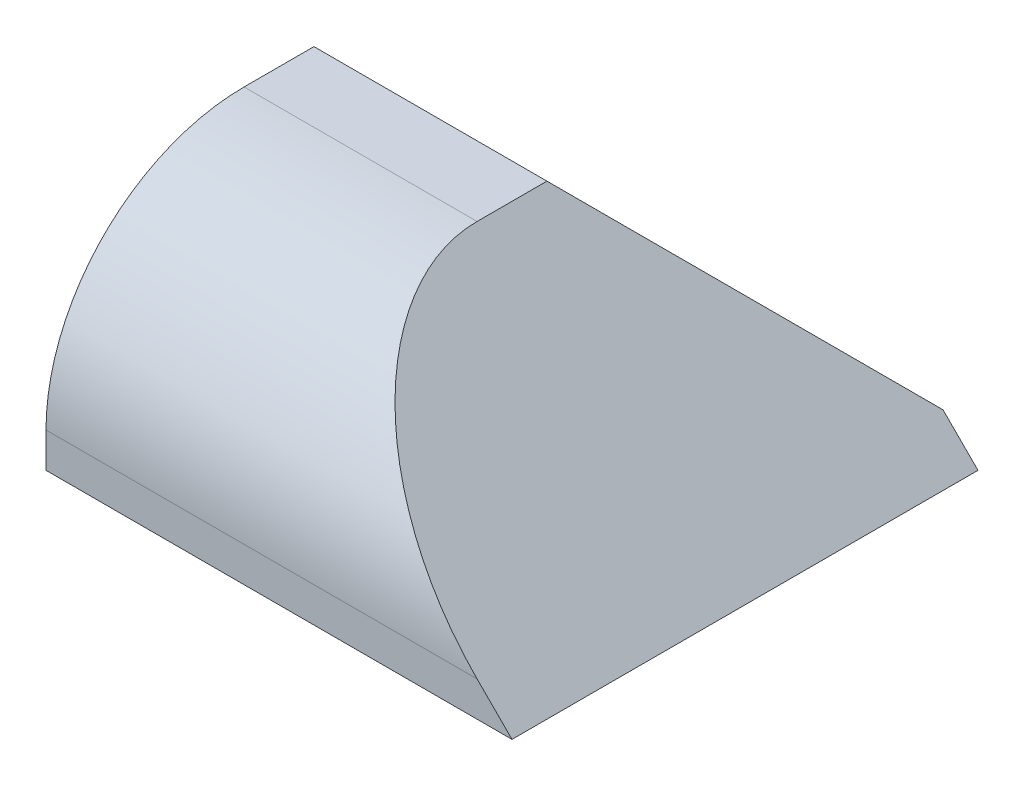
ISO-10303-21;
HEADER;
FILE_DESCRIPTION(('STEP AP214'),'2;1');
FILE_NAME('part.step','',(''),(''),'','','');
FILE_SCHEMA(('AUTOMOTIVE_DESIGN { 1 0 10303 214 1 1 1 1 }'));
ENDSEC;
DATA;
#1=APPLICATION_CONTEXT('core data for automotive mechanical design processes');
#2=APPLICATION_PROTOCOL_DEFINITION('international standard','automotive_design',2000,#1);
#3=PRODUCT_CONTEXT('',#1,'mechanical');
#4=PRODUCT('Part','Part','',(#3));
#5=PRODUCT_RELATED_PRODUCT_CATEGORY('part','',(#4));
#6=PRODUCT_DEFINITION_FORMATION('','',#4);
#7=PRODUCT_DEFINITION_CONTEXT('part definition',#1,'design');
#8=PRODUCT_DEFINITION('design','',#6,#7);
#9=PRODUCT_DEFINITION_SHAPE('','',#8);
#10=(LENGTH_UNIT() NAMED_UNIT(*) SI_UNIT(.MILLI.,.METRE.));
#11=(NAMED_UNIT(*) PLANE_ANGLE_UNIT() SI_UNIT($,.RADIAN.));
#12=(NAMED_UNIT(*) SI_UNIT($,.STERADIAN.) SOLID_ANGLE_UNIT());
#13=UNCERTAINTY_MEASURE_WITH_UNIT(LENGTH_MEASURE(1.E-05),#10,'distance_accuracy_value','');
#14=(GEOMETRIC_REPRESENTATION_CONTEXT(3) GLOBAL_UNCERTAINTY_ASSIGNED_CONTEXT((#13)) GLOBAL_UNIT_ASSIGNED_CONTEXT((#10,
#11,#12)) REPRESENTATION_CONTEXT('',''));
#15=CARTESIAN_POINT('',(0.,0.,0.));
#16=DIRECTION('',(0.,0.,1.));
#17=DIRECTION('',(1.,0.,0.));
#18=AXIS2_PLACEMENT_3D('',#15,#16,#17);
#19=CARTESIAN_POINT('',(0.,10.,-20.));
#20=DIRECTION('',(0.,-1.,0.));
#21=DIRECTION('',(0.,0.,-1.));
#22=AXIS2_PLACEMENT_3D('',#19,#20,#21);
#23=PLANE('',#22);
#24=DIRECTION('',(1.,0.,0.));
#25=VECTOR('',#24,1.);
#26=CARTESIAN_POINT('',(0.,10.,-8.5));
#27=LINE('',#26,#25);
#28=CARTESIAN_POINT('',(0.,10.,-8.5));
#29=VERTEX_POINT('',#28);
#30=CARTESIAN_POINT('',(10.0000000000001,10.,-8.5));
#31=VERTEX_POINT('',#30);
#32=EDGE_CURVE('E128',#29,#31,#27,.T.);
#33=ORIENTED_EDGE('',*,*,#32,.T.);
#34=DIRECTION('',(0.,0.,-1.));
#35=VECTOR('',#34,1.);
#36=CARTESIAN_POINT('',(10.0000000000001,10.,0.));
#37=LINE('',#36,#35);
#38=CARTESIAN_POINT('',(10.0000000000001,10.,-11.5000000000001));
#39=VERTEX_POINT('',#38);
#40=EDGE_CURVE('E46',#31,#39,#37,.T.);
#41=ORIENTED_EDGE('',*,*,#40,.T.);
#42=DIRECTION('',(1.,0.,0.));
#43=VECTOR('',#42,1.);
#44=CARTESIAN_POINT('',(0.,10.,-11.5000000000001));
#45=LINE('',#44,#43);
#46=CARTESIAN_POINT('',(0.,10.,-11.5000000000001));
#47=VERTEX_POINT('',#46);
#48=EDGE_CURVE('E120',#47,#39,#45,.T.);
#49=ORIENTED_EDGE('',*,*,#48,.F.);
#50=DIRECTION('',(0.,0.,1.));
#51=VECTOR('',#50,1.);
#52=CARTESIAN_POINT('',(0.,10.,0.));
#53=LINE('',#52,#51);
#54=EDGE_CURVE('E107',#47,#29,#53,.T.);
#55=ORIENTED_EDGE('',*,*,#54,.T.);
#56=EDGE_LOOP('',(#33,#41,#49,#55));
#57=FACE_BOUND('',#56,.T.);
#58=ADVANCED_FACE('F31',(#57),#23,.F.);
#59=CARTESIAN_POINT('',(0.,10.,0.));
#60=DIRECTION('',(1.,0.,0.));
#61=DIRECTION('',(0.,0.,-1.));
#62=AXIS2_PLACEMENT_3D('',#59,#60,#61);
#63=PLANE('',#62);
#64=DIRECTION('',(0.,-1.,0.));
#65=VECTOR('',#64,1.);
#66=CARTESIAN_POINT('',(0.,10.,0.));
#67=LINE('',#66,#65);
#68=CARTESIAN_POINT('',(0.,1.5,0.));
#69=VERTEX_POINT('',#68);
#70=CARTESIAN_POINT('',(0.,0.,0.));
#71=VERTEX_POINT('',#70);
#72=EDGE_CURVE('E39',#69,#71,#67,.T.);
#73=ORIENTED_EDGE('',*,*,#72,.F.);
#74=CARTESIAN_POINT('',(0.,1.5,-8.5));
#75=DIRECTION('',(-1.,0.,0.));
#76=DIRECTION('',(0.,0.,1.));
#77=AXIS2_PLACEMENT_3D('',#74,#75,#76);
#78=CIRCLE('',#77,8.5);
#79=EDGE_CURVE('E130',#69,#29,#78,.T.);
#80=ORIENTED_EDGE('',*,*,#79,.T.);
#81=ORIENTED_EDGE('',*,*,#54,.F.);
#82=DIRECTION('',(0.,-0.707106781186551,-0.707106781186544));
#83=VECTOR('',#82,1.);
#84=CARTESIAN_POINT('',(0.,1.5,-20.));
#85=LINE('',#84,#83);
#86=CARTESIAN_POINT('',(0.,1.5,-20.));
#87=VERTEX_POINT('',#86);
#88=EDGE_CURVE('E53',#47,#87,#85,.T.);
#89=ORIENTED_EDGE('',*,*,#88,.T.);
#90=DIRECTION('',(0.,-1.,0.));
#91=VECTOR('',#90,1.);
#92=CARTESIAN_POINT('',(0.,10.,-20.));
#93=LINE('',#92,#91);
#94=CARTESIAN_POINT('',(0.,0.,-20.));
#95=VERTEX_POINT('',#94);
#96=EDGE_CURVE('E111',#87,#95,#93,.T.);
#97=ORIENTED_EDGE('',*,*,#96,.T.);
#98=DIRECTION('',(0.,0.,1.));
#99=VECTOR('',#98,1.);
#100=CARTESIAN_POINT('',(0.,0.,0.));
#101=LINE('',#100,#99);
#102=EDGE_CURVE('E100',#95,#71,#101,.T.);
#103=ORIENTED_EDGE('',*,*,#102,.T.);
#104=EDGE_LOOP('',(#73,#80,#81,#89,#97,#103));
#105=FACE_BOUND('',#104,.T.);
#106=ADVANCED_FACE('F33',(#105),#63,.F.);
#107=CARTESIAN_POINT('',(0.,10.,0.));
#108=DIRECTION('',(0.,0.,-1.));
#109=DIRECTION('',(-1.,0.,0.));
#110=AXIS2_PLACEMENT_3D('',#107,#108,#109);
#111=PLANE('',#110);
#112=DIRECTION('',(1.,0.,0.));
#113=VECTOR('',#112,1.);
#114=CARTESIAN_POINT('',(0.,0.,0.));
#115=LINE('',#114,#113);
#116=CARTESIAN_POINT('',(20.,0.,0.));
#117=VERTEX_POINT('',#116);
#118=EDGE_CURVE('E94',#71,#117,#115,.T.);
#119=ORIENTED_EDGE('',*,*,#118,.T.);
#120=DIRECTION('',(-0.707106781186544,0.707106781186552,0.));
#121=VECTOR('',#120,1.);
#122=CARTESIAN_POINT('',(20.,0.,0.));
#123=LINE('',#122,#121);
#124=CARTESIAN_POINT('',(18.5,1.5,0.));
#125=VERTEX_POINT('',#124);
#126=EDGE_CURVE('E82',#117,#125,#123,.T.);
#127=ORIENTED_EDGE('',*,*,#126,.T.);
#128=DIRECTION('',(1.,0.,0.));
#129=VECTOR('',#128,1.);
#130=CARTESIAN_POINT('',(0.,1.5,0.));
#131=LINE('',#130,#129);
#132=EDGE_CURVE('E127',#69,#125,#131,.T.);
#133=ORIENTED_EDGE('',*,*,#132,.F.);
#134=ORIENTED_EDGE('',*,*,#72,.T.);
#135=EDGE_LOOP('',(#119,#127,#133,#134));
#136=FACE_BOUND('',#135,.T.);
#137=ADVANCED_FACE('F95',(#136),#111,.F.);
#138=CARTESIAN_POINT('',(0.,10.,-20.));
#139=DIRECTION('',(0.,0.,1.));
#140=DIRECTION('',(1.,0.,0.));
#141=AXIS2_PLACEMENT_3D('',#138,#139,#140);
#142=PLANE('',#141);
#143=DIRECTION('',(1.,0.,0.));
#144=VECTOR('',#143,1.);
#145=CARTESIAN_POINT('',(0.,1.5,-20.));
#146=LINE('',#145,#144);
#147=CARTESIAN_POINT('',(18.5,1.5,-20.));
#148=VERTEX_POINT('',#147);
#149=EDGE_CURVE('E122',#87,#148,#146,.T.);
#150=ORIENTED_EDGE('',*,*,#149,.T.);
#151=DIRECTION('',(-0.707106781186544,0.707106781186552,0.));
#152=VECTOR('',#151,1.);
#153=CARTESIAN_POINT('',(20.,0.,-20.));
#154=LINE('',#153,#152);
#155=CARTESIAN_POINT('',(20.,0.,-20.));
#156=VERTEX_POINT('',#155);
#157=EDGE_CURVE('E91',#156,#148,#154,.T.);
#158=ORIENTED_EDGE('',*,*,#157,.F.);
#159=DIRECTION('',(-1.,0.,0.));
#160=VECTOR('',#159,1.);
#161=CARTESIAN_POINT('',(0.,0.,-20.));
#162=LINE('',#161,#160);
#163=EDGE_CURVE('E105',#156,#95,#162,.T.);
#164=ORIENTED_EDGE('',*,*,#163,.T.);
#165=ORIENTED_EDGE('',*,*,#96,.F.);
#166=EDGE_LOOP('',(#150,#158,#164,#165));
#167=FACE_BOUND('',#166,.T.);
#168=ADVANCED_FACE('F157',(#167),#142,.F.);
#169=CARTESIAN_POINT('',(0.,0.,-20.));
#170=DIRECTION('',(0.,-1.,0.));
#171=DIRECTION('',(0.,0.,-1.));
#172=AXIS2_PLACEMENT_3D('',#169,#170,#171);
#173=PLANE('',#172);
#174=ORIENTED_EDGE('',*,*,#102,.F.);
#175=ORIENTED_EDGE('',*,*,#163,.F.);
#176=DIRECTION('',(0.,0.,-1.));
#177=VECTOR('',#176,1.);
#178=CARTESIAN_POINT('',(20.,0.,0.));
#179=LINE('',#178,#177);
#180=EDGE_CURVE('E86',#117,#156,#179,.T.);
#181=ORIENTED_EDGE('',*,*,#180,.F.);
#182=ORIENTED_EDGE('',*,*,#118,.F.);
#183=EDGE_LOOP('',(#174,#175,#181,#182));
#184=FACE_BOUND('',#183,.T.);
#185=ADVANCED_FACE('F103',(#184),#173,.T.);
#186=CARTESIAN_POINT('',(0.,1.5,-20.));
#187=DIRECTION('',(0.,-0.707106781186544,0.707106781186551));
#188=DIRECTION('',(0.,-0.707106781186551,-0.707106781186544));
#189=AXIS2_PLACEMENT_3D('',#186,#187,#188);
#190=PLANE('',#189);
#191=ORIENTED_EDGE('',*,*,#48,.T.);
#192=DIRECTION('',(0.577350269189623,-0.57735026918963,-0.577350269189624));
#193=VECTOR('',#192,1.);
#194=CARTESIAN_POINT('',(12.3333333333334,7.66666666666669,-13.8333333333334));
#195=LINE('',#194,#193);
#196=EDGE_CURVE('E134',#39,#148,#195,.T.);
#197=ORIENTED_EDGE('',*,*,#196,.T.);
#198=ORIENTED_EDGE('',*,*,#149,.F.);
#199=ORIENTED_EDGE('',*,*,#88,.F.);
#200=EDGE_LOOP('',(#191,#197,#198,#199));
#201=FACE_BOUND('',#200,.T.);
#202=ADVANCED_FACE('F138',(#201),#190,.F.);
#203=CARTESIAN_POINT('',(0.,1.5,-8.5));
#204=DIRECTION('',(1.,0.,0.));
#205=DIRECTION('',(0.,0.,-1.));
#206=AXIS2_PLACEMENT_3D('',#203,#204,#205);
#207=CYLINDRICAL_SURFACE('',#206,8.5);
#208=ORIENTED_EDGE('',*,*,#132,.T.);
#209=CARTESIAN_POINT('',(18.5,1.5,-8.5));
#210=DIRECTION('',(-0.707106781186552,-0.707106781186544,0.));
#211=DIRECTION('',(0.707106781186544,-0.707106781186551,0.));
#212=AXIS2_PLACEMENT_3D('',#209,#210,#211);
#213=ELLIPSE('',#212,12.0208152801712,8.5);
#214=EDGE_CURVE('E11',#125,#31,#213,.T.);
#215=ORIENTED_EDGE('',*,*,#214,.T.);
#216=ORIENTED_EDGE('',*,*,#32,.F.);
#217=ORIENTED_EDGE('',*,*,#79,.F.);
#218=EDGE_LOOP('',(#208,#215,#216,#217));
#219=FACE_BOUND('',#218,.T.);
#220=ADVANCED_FACE('F140',(#219),#207,.T.);
#221=CARTESIAN_POINT('',(20.,0.,0.));
#222=DIRECTION('',(-0.707106781186552,-0.707106781186544,0.));
#223=DIRECTION('',(0.707106781186544,-0.707106781186551,0.));
#224=AXIS2_PLACEMENT_3D('',#221,#222,#223);
#225=PLANE('',#224);
#226=ORIENTED_EDGE('',*,*,#40,.F.);
#227=ORIENTED_EDGE('',*,*,#214,.F.);
#228=ORIENTED_EDGE('',*,*,#126,.F.);
#229=ORIENTED_EDGE('',*,*,#180,.T.);
#230=ORIENTED_EDGE('',*,*,#157,.T.);
#231=ORIENTED_EDGE('',*,*,#196,.F.);
#232=EDGE_LOOP('',(#226,#227,#228,#229,#230,#231));
#233=FACE_BOUND('',#232,.T.);
#234=ADVANCED_FACE('F84',(#233),#225,.F.);
#235=CLOSED_SHELL('',(#58,#106,#137,#168,#185,#202,#220,#234));
#236=MANIFOLD_SOLID_BREP('B2',#235);
#237=ADVANCED_BREP_SHAPE_REPRESENTATION('',(#18,#236),#14);
#238=SHAPE_DEFINITION_REPRESENTATION(#9,#237);
ENDSEC;
END-ISO-10303-21;
